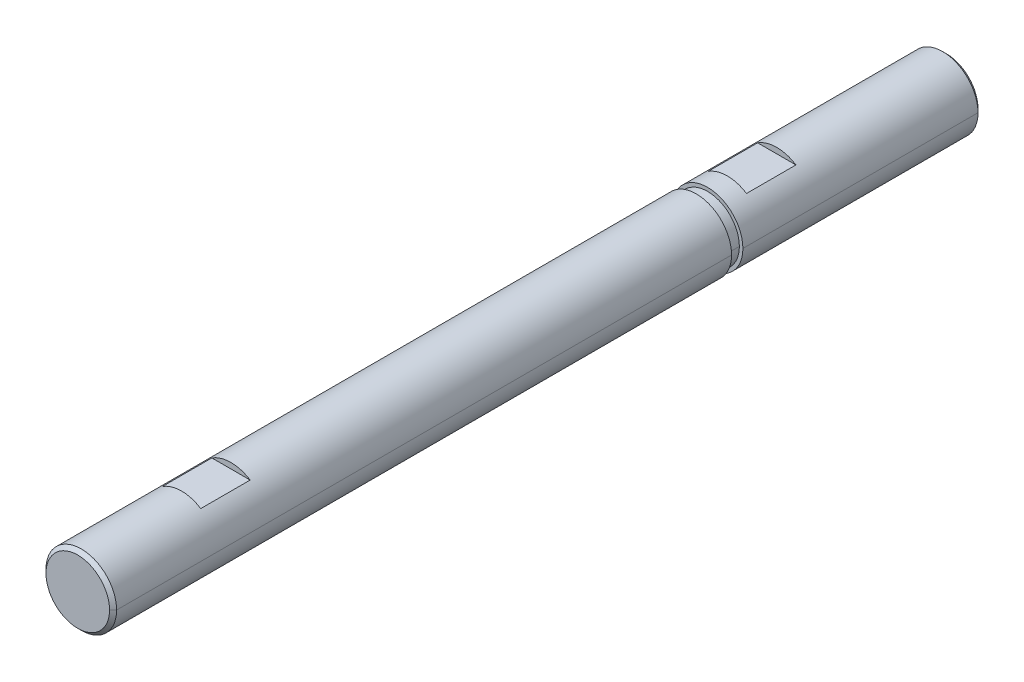
ISO-10303-21;
HEADER;
FILE_DESCRIPTION(('STEP AP214'),'2;1');
FILE_NAME('part.step','',(''),(''),'','','');
FILE_SCHEMA(('AUTOMOTIVE_DESIGN { 1 0 10303 214 1 1 1 1 }'));
ENDSEC;
DATA;
#1=APPLICATION_CONTEXT('core data for automotive mechanical design processes');
#2=APPLICATION_PROTOCOL_DEFINITION('international standard','automotive_design',2000,#1);
#3=PRODUCT_CONTEXT('',#1,'mechanical');
#4=PRODUCT('Part','Part','',(#3));
#5=PRODUCT_RELATED_PRODUCT_CATEGORY('part','',(#4));
#6=PRODUCT_DEFINITION_FORMATION('','',#4);
#7=PRODUCT_DEFINITION_CONTEXT('part definition',#1,'design');
#8=PRODUCT_DEFINITION('design','',#6,#7);
#9=PRODUCT_DEFINITION_SHAPE('','',#8);
#10=(LENGTH_UNIT() NAMED_UNIT(*) SI_UNIT(.MILLI.,.METRE.));
#11=(NAMED_UNIT(*) PLANE_ANGLE_UNIT() SI_UNIT($,.RADIAN.));
#12=(NAMED_UNIT(*) SI_UNIT($,.STERADIAN.) SOLID_ANGLE_UNIT());
#13=UNCERTAINTY_MEASURE_WITH_UNIT(LENGTH_MEASURE(1.E-05),#10,'distance_accuracy_value','');
#14=(GEOMETRIC_REPRESENTATION_CONTEXT(3) GLOBAL_UNCERTAINTY_ASSIGNED_CONTEXT((#13)) GLOBAL_UNIT_ASSIGNED_CONTEXT((#10,
#11,#12)) REPRESENTATION_CONTEXT('',''));
#15=CARTESIAN_POINT('',(0.,0.,0.));
#16=DIRECTION('',(0.,0.,1.));
#17=DIRECTION('',(1.,0.,0.));
#18=AXIS2_PLACEMENT_3D('',#15,#16,#17);
#19=CARTESIAN_POINT('',(0.,0.,61.5));
#20=DIRECTION('',(0.,0.,-1.));
#21=DIRECTION('',(-1.,0.,0.));
#22=AXIS2_PLACEMENT_3D('',#19,#20,#21);
#23=CYLINDRICAL_SURFACE('',#22,2.5);
#24=DIRECTION('',(0.,0.,-1.));
#25=VECTOR('',#24,1.);
#26=CARTESIAN_POINT('',(2.5,0.,61.5));
#27=LINE('',#26,#25);
#28=CARTESIAN_POINT('',(2.5,0.,16.9));
#29=VERTEX_POINT('',#28);
#30=CARTESIAN_POINT('',(2.5,0.,0.249999999999987));
#31=VERTEX_POINT('',#30);
#32=EDGE_CURVE('E203',#29,#31,#27,.T.);
#33=ORIENTED_EDGE('',*,*,#32,.F.);
#34=CARTESIAN_POINT('',(0.,0.,16.9));
#35=DIRECTION('',(0.,0.,1.));
#36=DIRECTION('',(1.,0.,0.));
#37=AXIS2_PLACEMENT_3D('',#34,#35,#36);
#38=CIRCLE('',#37,2.5);
#39=CARTESIAN_POINT('',(-2.5,0.,16.9));
#40=VERTEX_POINT('',#39);
#41=EDGE_CURVE('E160',#40,#29,#38,.T.);
#42=ORIENTED_EDGE('',*,*,#41,.F.);
#43=DIRECTION('',(0.,0.,-1.));
#44=VECTOR('',#43,1.);
#45=CARTESIAN_POINT('',(-2.5,0.,61.5));
#46=LINE('',#45,#44);
#47=CARTESIAN_POINT('',(-2.5,0.,0.249999999999987));
#48=VERTEX_POINT('',#47);
#49=EDGE_CURVE('E202',#40,#48,#46,.T.);
#50=ORIENTED_EDGE('',*,*,#49,.T.);
#51=CARTESIAN_POINT('',(0.,0.,0.249999999999987));
#52=DIRECTION('',(0.,0.,1.));
#53=DIRECTION('',(1.,0.,0.));
#54=AXIS2_PLACEMENT_3D('',#51,#52,#53);
#55=CIRCLE('',#54,2.5);
#56=EDGE_CURVE('E11',#48,#31,#55,.T.);
#57=ORIENTED_EDGE('',*,*,#56,.T.);
#58=EDGE_LOOP('',(#33,#42,#50,#57));
#59=FACE_BOUND('',#58,.T.);
#60=ADVANCED_FACE('F16',(#59),#23,.T.);
#61=CARTESIAN_POINT('',(0.,0.,0.249999999999987));
#62=DIRECTION('',(0.,0.,1.));
#63=DIRECTION('',(1.,0.,0.));
#64=AXIS2_PLACEMENT_3D('',#61,#62,#63);
#65=CONICAL_SURFACE('',#64,2.5,0.785398163397457);
#66=DIRECTION('',(-0.707106781186554,0.,0.707106781186541));
#67=VECTOR('',#66,1.);
#68=CARTESIAN_POINT('',(-2.5,0.,0.249999999999987));
#69=LINE('',#68,#67);
#70=CARTESIAN_POINT('',(-2.25,0.,0.));
#71=VERTEX_POINT('',#70);
#72=EDGE_CURVE('E180',#71,#48,#69,.T.);
#73=ORIENTED_EDGE('',*,*,#72,.F.);
#74=CARTESIAN_POINT('',(0.,0.,0.));
#75=DIRECTION('',(0.,0.,-1.));
#76=DIRECTION('',(1.,0.,0.));
#77=AXIS2_PLACEMENT_3D('',#74,#75,#76);
#78=CIRCLE('',#77,2.25);
#79=CARTESIAN_POINT('',(2.25,0.,0.));
#80=VERTEX_POINT('',#79);
#81=EDGE_CURVE('E87',#80,#71,#78,.T.);
#82=ORIENTED_EDGE('',*,*,#81,.F.);
#83=DIRECTION('',(0.707106781186554,0.,0.707106781186541));
#84=VECTOR('',#83,1.);
#85=CARTESIAN_POINT('',(2.5,0.,0.249999999999987));
#86=LINE('',#85,#84);
#87=EDGE_CURVE('E176',#80,#31,#86,.T.);
#88=ORIENTED_EDGE('',*,*,#87,.T.);
#89=ORIENTED_EDGE('',*,*,#56,.F.);
#90=EDGE_LOOP('',(#73,#82,#88,#89));
#91=FACE_BOUND('',#90,.T.);
#92=ADVANCED_FACE('F337',(#91),#65,.T.);
#93=CARTESIAN_POINT('',(-2.5,3.44225365935192,15.5));
#94=DIRECTION('',(0.,0.,1.));
#95=DIRECTION('',(1.,0.,0.));
#96=AXIS2_PLACEMENT_3D('',#93,#94,#95);
#97=PLANE('',#96);
#98=DIRECTION('',(1.,0.,0.));
#99=VECTOR('',#98,1.);
#100=CARTESIAN_POINT('',(-2.5,2.1,15.5));
#101=LINE('',#100,#99);
#102=CARTESIAN_POINT('',(-1.35646599662505,2.1,15.5));
#103=VERTEX_POINT('',#102);
#104=CARTESIAN_POINT('',(1.35646599662505,2.1,15.5));
#105=VERTEX_POINT('',#104);
#106=EDGE_CURVE('E27',#103,#105,#101,.T.);
#107=ORIENTED_EDGE('',*,*,#106,.F.);
#108=CARTESIAN_POINT('',(0.,0.,15.5));
#109=DIRECTION('',(0.,0.,1.));
#110=DIRECTION('',(1.,0.,0.));
#111=AXIS2_PLACEMENT_3D('',#108,#109,#110);
#112=CIRCLE('',#111,2.5);
#113=EDGE_CURVE('E245',#105,#103,#112,.T.);
#114=ORIENTED_EDGE('',*,*,#113,.F.);
#115=EDGE_LOOP('',(#107,#114));
#116=FACE_BOUND('',#115,.T.);
#117=ADVANCED_FACE('F342',(#116),#97,.F.);
#118=CARTESIAN_POINT('',(-2.5,2.1,15.5));
#119=DIRECTION('',(0.,-1.,0.));
#120=DIRECTION('',(0.,0.,-1.));
#121=AXIS2_PLACEMENT_3D('',#118,#119,#120);
#122=PLANE('',#121);
#123=ORIENTED_EDGE('',*,*,#106,.T.);
#124=DIRECTION('',(0.,0.,1.));
#125=VECTOR('',#124,1.);
#126=CARTESIAN_POINT('',(1.35646599662505,2.1,61.5));
#127=LINE('',#126,#125);
#128=CARTESIAN_POINT('',(1.35646599662505,2.1,12.));
#129=VERTEX_POINT('',#128);
#130=EDGE_CURVE('E246',#129,#105,#127,.T.);
#131=ORIENTED_EDGE('',*,*,#130,.F.);
#132=DIRECTION('',(1.,0.,0.));
#133=VECTOR('',#132,1.);
#134=CARTESIAN_POINT('',(-2.5,2.1,12.));
#135=LINE('',#134,#133);
#136=CARTESIAN_POINT('',(-1.35646599662505,2.1,12.));
#137=VERTEX_POINT('',#136);
#138=EDGE_CURVE('E190',#137,#129,#135,.T.);
#139=ORIENTED_EDGE('',*,*,#138,.F.);
#140=DIRECTION('',(0.,0.,-1.));
#141=VECTOR('',#140,1.);
#142=CARTESIAN_POINT('',(-1.35646599662505,2.1,61.5));
#143=LINE('',#142,#141);
#144=EDGE_CURVE('E256',#103,#137,#143,.T.);
#145=ORIENTED_EDGE('',*,*,#144,.F.);
#146=EDGE_LOOP('',(#123,#131,#139,#145));
#147=FACE_BOUND('',#146,.T.);
#148=ADVANCED_FACE('F362',(#147),#122,.F.);
#149=CARTESIAN_POINT('',(-2.5,3.44225365935192,12.));
#150=DIRECTION('',(0.,0.,-1.));
#151=DIRECTION('',(0.,-1.,0.));
#152=AXIS2_PLACEMENT_3D('',#149,#150,#151);
#153=PLANE('',#152);
#154=ORIENTED_EDGE('',*,*,#138,.T.);
#155=CARTESIAN_POINT('',(0.,0.,12.));
#156=DIRECTION('',(0.,0.,-1.));
#157=DIRECTION('',(-1.,0.,0.));
#158=AXIS2_PLACEMENT_3D('',#155,#156,#157);
#159=CIRCLE('',#158,2.5);
#160=EDGE_CURVE('E251',#137,#129,#159,.T.);
#161=ORIENTED_EDGE('',*,*,#160,.F.);
#162=EDGE_LOOP('',(#154,#161));
#163=FACE_BOUND('',#162,.T.);
#164=ADVANCED_FACE('F359',(#163),#153,.F.);
#165=CARTESIAN_POINT('',(0.,0.,0.));
#166=DIRECTION('',(0.,0.,1.));
#167=DIRECTION('',(1.,0.,0.));
#168=AXIS2_PLACEMENT_3D('',#165,#166,#167);
#169=PLANE('',#168);
#170=ORIENTED_EDGE('',*,*,#81,.T.);
#171=CARTESIAN_POINT('',(0.,0.,0.));
#172=DIRECTION('',(0.,0.,-1.));
#173=DIRECTION('',(1.,0.,0.));
#174=AXIS2_PLACEMENT_3D('',#171,#172,#173);
#175=CIRCLE('',#174,2.25);
#176=EDGE_CURVE('E250',#71,#80,#175,.T.);
#177=ORIENTED_EDGE('',*,*,#176,.T.);
#178=EDGE_LOOP('',(#170,#177));
#179=FACE_BOUND('',#178,.T.);
#180=ADVANCED_FACE('F349',(#179),#169,.F.);
#181=CARTESIAN_POINT('',(0.,0.,64.575));
#182=DIRECTION('',(0.,0.,1.));
#183=DIRECTION('',(1.,0.,0.));
#184=AXIS2_PLACEMENT_3D('',#181,#182,#183);
#185=CYLINDRICAL_SURFACE('',#184,2.25);
#186=DIRECTION('',(0.,0.,1.));
#187=VECTOR('',#186,1.);
#188=CARTESIAN_POINT('',(-2.25,0.,64.575));
#189=LINE('',#188,#187);
#190=CARTESIAN_POINT('',(-2.25,0.,16.9));
#191=VERTEX_POINT('',#190);
#192=CARTESIAN_POINT('',(-2.25,0.,17.7));
#193=VERTEX_POINT('',#192);
#194=EDGE_CURVE('E153',#191,#193,#189,.T.);
#195=ORIENTED_EDGE('',*,*,#194,.F.);
#196=CARTESIAN_POINT('',(0.,0.,16.9));
#197=DIRECTION('',(0.,0.,1.));
#198=DIRECTION('',(1.,0.,0.));
#199=AXIS2_PLACEMENT_3D('',#196,#197,#198);
#200=CIRCLE('',#199,2.25);
#201=CARTESIAN_POINT('',(2.25,0.,16.9));
#202=VERTEX_POINT('',#201);
#203=EDGE_CURVE('E191',#191,#202,#200,.T.);
#204=ORIENTED_EDGE('',*,*,#203,.T.);
#205=DIRECTION('',(0.,0.,1.));
#206=VECTOR('',#205,1.);
#207=CARTESIAN_POINT('',(2.25,0.,64.575));
#208=LINE('',#207,#206);
#209=CARTESIAN_POINT('',(2.25,0.,17.7));
#210=VERTEX_POINT('',#209);
#211=EDGE_CURVE('E156',#202,#210,#208,.T.);
#212=ORIENTED_EDGE('',*,*,#211,.T.);
#213=CARTESIAN_POINT('',(0.,0.,17.7));
#214=DIRECTION('',(0.,0.,1.));
#215=DIRECTION('',(1.,0.,0.));
#216=AXIS2_PLACEMENT_3D('',#213,#214,#215);
#217=CIRCLE('',#216,2.25);
#218=EDGE_CURVE('E20',#193,#210,#217,.T.);
#219=ORIENTED_EDGE('',*,*,#218,.F.);
#220=EDGE_LOOP('',(#195,#204,#212,#219));
#221=FACE_BOUND('',#220,.T.);
#222=ADVANCED_FACE('F151',(#221),#185,.T.);
#223=CARTESIAN_POINT('',(0.,3.3259542693505,16.9));
#224=DIRECTION('',(0.,0.,1.));
#225=DIRECTION('',(1.,0.,0.));
#226=AXIS2_PLACEMENT_3D('',#223,#224,#225);
#227=PLANE('',#226);
#228=CARTESIAN_POINT('',(0.,0.,16.9));
#229=DIRECTION('',(0.,0.,1.));
#230=DIRECTION('',(1.,0.,0.));
#231=AXIS2_PLACEMENT_3D('',#228,#229,#230);
#232=CIRCLE('',#231,2.25);
#233=EDGE_CURVE('E169',#202,#191,#232,.T.);
#234=ORIENTED_EDGE('',*,*,#233,.F.);
#235=ORIENTED_EDGE('',*,*,#203,.F.);
#236=EDGE_LOOP('',(#234,#235));
#237=FACE_BOUND('',#236,.T.);
#238=ORIENTED_EDGE('',*,*,#41,.T.);
#239=CARTESIAN_POINT('',(0.,0.,16.9));
#240=DIRECTION('',(0.,0.,1.));
#241=DIRECTION('',(1.,0.,0.));
#242=AXIS2_PLACEMENT_3D('',#239,#240,#241);
#243=CIRCLE('',#242,2.5);
#244=EDGE_CURVE('E235',#29,#40,#243,.T.);
#245=ORIENTED_EDGE('',*,*,#244,.T.);
#246=EDGE_LOOP('',(#238,#245));
#247=FACE_BOUND('',#246,.T.);
#248=ADVANCED_FACE('F322',(#237,#247),#227,.T.);
#249=CARTESIAN_POINT('',(0.,3.3259542693505,17.7));
#250=DIRECTION('',(0.,0.,-1.));
#251=DIRECTION('',(0.,-1.,0.));
#252=AXIS2_PLACEMENT_3D('',#249,#250,#251);
#253=PLANE('',#252);
#254=CARTESIAN_POINT('',(0.,0.,17.7));
#255=DIRECTION('',(0.,0.,1.));
#256=DIRECTION('',(1.,0.,0.));
#257=AXIS2_PLACEMENT_3D('',#254,#255,#256);
#258=CIRCLE('',#257,2.25);
#259=EDGE_CURVE('E161',#210,#193,#258,.T.);
#260=ORIENTED_EDGE('',*,*,#259,.T.);
#261=ORIENTED_EDGE('',*,*,#218,.T.);
#262=EDGE_LOOP('',(#260,#261));
#263=FACE_BOUND('',#262,.T.);
#264=CARTESIAN_POINT('',(0.,0.,17.7));
#265=DIRECTION('',(0.,0.,-1.));
#266=DIRECTION('',(-1.,0.,0.));
#267=AXIS2_PLACEMENT_3D('',#264,#265,#266);
#268=CIRCLE('',#267,2.5);
#269=CARTESIAN_POINT('',(-2.5,0.,17.7));
#270=VERTEX_POINT('',#269);
#271=CARTESIAN_POINT('',(2.5,0.,17.7));
#272=VERTEX_POINT('',#271);
#273=EDGE_CURVE('E187',#270,#272,#268,.T.);
#274=ORIENTED_EDGE('',*,*,#273,.T.);
#275=CARTESIAN_POINT('',(0.,0.,17.7));
#276=DIRECTION('',(0.,0.,-1.));
#277=DIRECTION('',(-1.,0.,0.));
#278=AXIS2_PLACEMENT_3D('',#275,#276,#277);
#279=CIRCLE('',#278,2.5);
#280=EDGE_CURVE('E242',#272,#270,#279,.T.);
#281=ORIENTED_EDGE('',*,*,#280,.T.);
#282=EDGE_LOOP('',(#274,#281));
#283=FACE_BOUND('',#282,.T.);
#284=ADVANCED_FACE('F162',(#263,#283),#253,.T.);
#285=CARTESIAN_POINT('',(-2.5,2.1,54.15));
#286=DIRECTION('',(0.,-1.,0.));
#287=DIRECTION('',(0.,0.,-1.));
#288=AXIS2_PLACEMENT_3D('',#285,#286,#287);
#289=PLANE('',#288);
#290=DIRECTION('',(1.,0.,0.));
#291=VECTOR('',#290,1.);
#292=CARTESIAN_POINT('',(-2.5,2.1,54.15));
#293=LINE('',#292,#291);
#294=CARTESIAN_POINT('',(-1.35646599662505,2.1,54.15));
#295=VERTEX_POINT('',#294);
#296=CARTESIAN_POINT('',(1.35646599662505,2.1,54.15));
#297=VERTEX_POINT('',#296);
#298=EDGE_CURVE('E214',#295,#297,#293,.T.);
#299=ORIENTED_EDGE('',*,*,#298,.T.);
#300=DIRECTION('',(0.,0.,1.));
#301=VECTOR('',#300,1.);
#302=CARTESIAN_POINT('',(1.35646599662505,2.1,61.5));
#303=LINE('',#302,#301);
#304=CARTESIAN_POINT('',(1.35646599662505,2.1,50.65));
#305=VERTEX_POINT('',#304);
#306=EDGE_CURVE('E228',#305,#297,#303,.T.);
#307=ORIENTED_EDGE('',*,*,#306,.F.);
#308=DIRECTION('',(1.,0.,0.));
#309=VECTOR('',#308,1.);
#310=CARTESIAN_POINT('',(-2.5,2.1,50.65));
#311=LINE('',#310,#309);
#312=CARTESIAN_POINT('',(-1.35646599662505,2.1,50.65));
#313=VERTEX_POINT('',#312);
#314=EDGE_CURVE('E41',#313,#305,#311,.T.);
#315=ORIENTED_EDGE('',*,*,#314,.F.);
#316=DIRECTION('',(0.,0.,-1.));
#317=VECTOR('',#316,1.);
#318=CARTESIAN_POINT('',(-1.35646599662505,2.1,61.5));
#319=LINE('',#318,#317);
#320=EDGE_CURVE('E204',#295,#313,#319,.T.);
#321=ORIENTED_EDGE('',*,*,#320,.F.);
#322=EDGE_LOOP('',(#299,#307,#315,#321));
#323=FACE_BOUND('',#322,.T.);
#324=ADVANCED_FACE('F321',(#323),#289,.F.);
#325=CARTESIAN_POINT('',(-2.5,3.44225365935192,50.65));
#326=DIRECTION('',(0.,0.,-1.));
#327=DIRECTION('',(0.,-1.,0.));
#328=AXIS2_PLACEMENT_3D('',#325,#326,#327);
#329=PLANE('',#328);
#330=ORIENTED_EDGE('',*,*,#314,.T.);
#331=CARTESIAN_POINT('',(0.,0.,50.65));
#332=DIRECTION('',(0.,0.,-1.));
#333=DIRECTION('',(-1.,0.,0.));
#334=AXIS2_PLACEMENT_3D('',#331,#332,#333);
#335=CIRCLE('',#334,2.5);
#336=EDGE_CURVE('E208',#313,#305,#335,.T.);
#337=ORIENTED_EDGE('',*,*,#336,.F.);
#338=EDGE_LOOP('',(#330,#337));
#339=FACE_BOUND('',#338,.T.);
#340=ADVANCED_FACE('F329',(#339),#329,.F.);
#341=CARTESIAN_POINT('',(-2.5,3.44225365935192,54.15));
#342=DIRECTION('',(0.,0.,1.));
#343=DIRECTION('',(1.,0.,0.));
#344=AXIS2_PLACEMENT_3D('',#341,#342,#343);
#345=PLANE('',#344);
#346=ORIENTED_EDGE('',*,*,#298,.F.);
#347=CARTESIAN_POINT('',(0.,0.,54.15));
#348=DIRECTION('',(0.,0.,1.));
#349=DIRECTION('',(1.,0.,0.));
#350=AXIS2_PLACEMENT_3D('',#347,#348,#349);
#351=CIRCLE('',#350,2.5);
#352=EDGE_CURVE('E186',#297,#295,#351,.T.);
#353=ORIENTED_EDGE('',*,*,#352,.F.);
#354=EDGE_LOOP('',(#346,#353));
#355=FACE_BOUND('',#354,.T.);
#356=ADVANCED_FACE('F350',(#355),#345,.F.);
#357=CARTESIAN_POINT('',(0.,0.,61.5));
#358=DIRECTION('',(0.,0.,-1.));
#359=DIRECTION('',(-1.,0.,0.));
#360=AXIS2_PLACEMENT_3D('',#357,#358,#359);
#361=CONICAL_SURFACE('',#360,2.25,0.785398163397457);
#362=DIRECTION('',(0.707106781186554,0.,-0.707106781186541));
#363=VECTOR('',#362,1.);
#364=CARTESIAN_POINT('',(2.25,0.,61.5));
#365=LINE('',#364,#363);
#366=CARTESIAN_POINT('',(2.25,0.,61.5));
#367=VERTEX_POINT('',#366);
#368=CARTESIAN_POINT('',(2.5,0.,61.25));
#369=VERTEX_POINT('',#368);
#370=EDGE_CURVE('E274',#367,#369,#365,.T.);
#371=ORIENTED_EDGE('',*,*,#370,.F.);
#372=CARTESIAN_POINT('',(0.,0.,61.5));
#373=DIRECTION('',(0.,0.,1.));
#374=DIRECTION('',(1.,0.,0.));
#375=AXIS2_PLACEMENT_3D('',#372,#373,#374);
#376=CIRCLE('',#375,2.25);
#377=CARTESIAN_POINT('',(-2.25,0.,61.5));
#378=VERTEX_POINT('',#377);
#379=EDGE_CURVE('E239',#378,#367,#376,.T.);
#380=ORIENTED_EDGE('',*,*,#379,.F.);
#381=DIRECTION('',(-0.707106781186554,0.,-0.707106781186541));
#382=VECTOR('',#381,1.);
#383=CARTESIAN_POINT('',(-2.25,0.,61.5));
#384=LINE('',#383,#382);
#385=CARTESIAN_POINT('',(-2.5,0.,61.25));
#386=VERTEX_POINT('',#385);
#387=EDGE_CURVE('E192',#378,#386,#384,.T.);
#388=ORIENTED_EDGE('',*,*,#387,.T.);
#389=CARTESIAN_POINT('',(0.,0.,61.25));
#390=DIRECTION('',(0.,0.,-1.));
#391=DIRECTION('',(1.,0.,0.));
#392=AXIS2_PLACEMENT_3D('',#389,#390,#391);
#393=CIRCLE('',#392,2.5);
#394=EDGE_CURVE('E276',#369,#386,#393,.T.);
#395=ORIENTED_EDGE('',*,*,#394,.F.);
#396=EDGE_LOOP('',(#371,#380,#388,#395));
#397=FACE_BOUND('',#396,.T.);
#398=ADVANCED_FACE('F313',(#397),#361,.T.);
#399=CARTESIAN_POINT('',(0.,0.,61.5));
#400=DIRECTION('',(0.,0.,1.));
#401=DIRECTION('',(1.,0.,0.));
#402=AXIS2_PLACEMENT_3D('',#399,#400,#401);
#403=PLANE('',#402);
#404=ORIENTED_EDGE('',*,*,#379,.T.);
#405=CARTESIAN_POINT('',(0.,0.,61.5));
#406=DIRECTION('',(0.,0.,1.));
#407=DIRECTION('',(1.,0.,0.));
#408=AXIS2_PLACEMENT_3D('',#405,#406,#407);
#409=CIRCLE('',#408,2.25);
#410=EDGE_CURVE('E219',#367,#378,#409,.T.);
#411=ORIENTED_EDGE('',*,*,#410,.T.);
#412=EDGE_LOOP('',(#404,#411));
#413=FACE_BOUND('',#412,.T.);
#414=ADVANCED_FACE('F357',(#413),#403,.T.);
#415=CARTESIAN_POINT('',(0.,0.,61.5));
#416=DIRECTION('',(0.,0.,-1.));
#417=DIRECTION('',(-1.,0.,0.));
#418=AXIS2_PLACEMENT_3D('',#415,#416,#417);
#419=CYLINDRICAL_SURFACE('',#418,2.5);
#420=DIRECTION('',(0.,0.,-1.));
#421=VECTOR('',#420,1.);
#422=CARTESIAN_POINT('',(2.5,0.,61.5));
#423=LINE('',#422,#421);
#424=EDGE_CURVE('E196',#369,#272,#423,.T.);
#425=ORIENTED_EDGE('',*,*,#424,.F.);
#426=ORIENTED_EDGE('',*,*,#394,.T.);
#427=DIRECTION('',(0.,0.,-1.));
#428=VECTOR('',#427,1.);
#429=CARTESIAN_POINT('',(-2.5,0.,61.5));
#430=LINE('',#429,#428);
#431=EDGE_CURVE('E182',#386,#270,#430,.T.);
#432=ORIENTED_EDGE('',*,*,#431,.T.);
#433=ORIENTED_EDGE('',*,*,#280,.F.);
#434=EDGE_LOOP('',(#425,#426,#432,#433));
#435=FACE_BOUND('',#434,.T.);
#436=ADVANCED_FACE('F317',(#435),#419,.T.);
#437=CARTESIAN_POINT('',(0.,0.,61.5));
#438=DIRECTION('',(0.,0.,-1.));
#439=DIRECTION('',(-1.,0.,0.));
#440=AXIS2_PLACEMENT_3D('',#437,#438,#439);
#441=CYLINDRICAL_SURFACE('',#440,2.5);
#442=ORIENTED_EDGE('',*,*,#352,.T.);
#443=ORIENTED_EDGE('',*,*,#320,.T.);
#444=ORIENTED_EDGE('',*,*,#336,.T.);
#445=ORIENTED_EDGE('',*,*,#306,.T.);
#446=EDGE_LOOP('',(#442,#443,#444,#445));
#447=FACE_BOUND('',#446,.T.);
#448=CARTESIAN_POINT('',(0.,0.,61.25));
#449=DIRECTION('',(0.,0.,-1.));
#450=DIRECTION('',(1.,0.,0.));
#451=AXIS2_PLACEMENT_3D('',#448,#449,#450);
#452=CIRCLE('',#451,2.5);
#453=EDGE_CURVE('E197',#386,#369,#452,.T.);
#454=ORIENTED_EDGE('',*,*,#453,.T.);
#455=ORIENTED_EDGE('',*,*,#424,.T.);
#456=ORIENTED_EDGE('',*,*,#273,.F.);
#457=ORIENTED_EDGE('',*,*,#431,.F.);
#458=EDGE_LOOP('',(#454,#455,#456,#457));
#459=FACE_BOUND('',#458,.T.);
#460=ADVANCED_FACE('F18',(#447,#459),#441,.T.);
#461=CARTESIAN_POINT('',(0.,0.,61.5));
#462=DIRECTION('',(0.,0.,-1.));
#463=DIRECTION('',(-1.,0.,0.));
#464=AXIS2_PLACEMENT_3D('',#461,#462,#463);
#465=CONICAL_SURFACE('',#464,2.25,0.785398163397457);
#466=ORIENTED_EDGE('',*,*,#410,.F.);
#467=ORIENTED_EDGE('',*,*,#370,.T.);
#468=ORIENTED_EDGE('',*,*,#453,.F.);
#469=ORIENTED_EDGE('',*,*,#387,.F.);
#470=EDGE_LOOP('',(#466,#467,#468,#469));
#471=FACE_BOUND('',#470,.T.);
#472=ADVANCED_FACE('F310',(#471),#465,.T.);
#473=CARTESIAN_POINT('',(0.,0.,64.575));
#474=DIRECTION('',(0.,0.,1.));
#475=DIRECTION('',(1.,0.,0.));
#476=AXIS2_PLACEMENT_3D('',#473,#474,#475);
#477=CYLINDRICAL_SURFACE('',#476,2.25);
#478=ORIENTED_EDGE('',*,*,#233,.T.);
#479=ORIENTED_EDGE('',*,*,#194,.T.);
#480=ORIENTED_EDGE('',*,*,#259,.F.);
#481=ORIENTED_EDGE('',*,*,#211,.F.);
#482=EDGE_LOOP('',(#478,#479,#480,#481));
#483=FACE_BOUND('',#482,.T.);
#484=ADVANCED_FACE('F167',(#483),#477,.T.);
#485=CARTESIAN_POINT('',(0.,0.,0.249999999999987));
#486=DIRECTION('',(0.,0.,1.));
#487=DIRECTION('',(1.,0.,0.));
#488=AXIS2_PLACEMENT_3D('',#485,#486,#487);
#489=CONICAL_SURFACE('',#488,2.5,0.785398163397457);
#490=ORIENTED_EDGE('',*,*,#176,.F.);
#491=ORIENTED_EDGE('',*,*,#72,.T.);
#492=CARTESIAN_POINT('',(0.,0.,0.249999999999987));
#493=DIRECTION('',(0.,0.,1.));
#494=DIRECTION('',(1.,0.,0.));
#495=AXIS2_PLACEMENT_3D('',#492,#493,#494);
#496=CIRCLE('',#495,2.5);
#497=EDGE_CURVE('E198',#31,#48,#496,.T.);
#498=ORIENTED_EDGE('',*,*,#497,.F.);
#499=ORIENTED_EDGE('',*,*,#87,.F.);
#500=EDGE_LOOP('',(#490,#491,#498,#499));
#501=FACE_BOUND('',#500,.T.);
#502=ADVANCED_FACE('F346',(#501),#489,.T.);
#503=CARTESIAN_POINT('',(0.,0.,61.5));
#504=DIRECTION('',(0.,0.,-1.));
#505=DIRECTION('',(-1.,0.,0.));
#506=AXIS2_PLACEMENT_3D('',#503,#504,#505);
#507=CYLINDRICAL_SURFACE('',#506,2.5);
#508=ORIENTED_EDGE('',*,*,#113,.T.);
#509=ORIENTED_EDGE('',*,*,#144,.T.);
#510=ORIENTED_EDGE('',*,*,#160,.T.);
#511=ORIENTED_EDGE('',*,*,#130,.T.);
#512=EDGE_LOOP('',(#508,#509,#510,#511));
#513=FACE_BOUND('',#512,.T.);
#514=ORIENTED_EDGE('',*,*,#244,.F.);
#515=ORIENTED_EDGE('',*,*,#32,.T.);
#516=ORIENTED_EDGE('',*,*,#497,.T.);
#517=ORIENTED_EDGE('',*,*,#49,.F.);
#518=EDGE_LOOP('',(#514,#515,#516,#517));
#519=FACE_BOUND('',#518,.T.);
#520=ADVANCED_FACE('F386',(#513,#519),#507,.T.);
#521=CLOSED_SHELL('',(#60,#92,#117,#148,#164,#180,#222,#248,#284,#324,#340,#356,#398,#414,#436,
#460,#472,#484,#502,#520));
#522=MANIFOLD_SOLID_BREP('B1',#521);
#523=ADVANCED_BREP_SHAPE_REPRESENTATION('',(#18,#522),#14);
#524=SHAPE_DEFINITION_REPRESENTATION(#9,#523);
ENDSEC;
END-ISO-10303-21;
